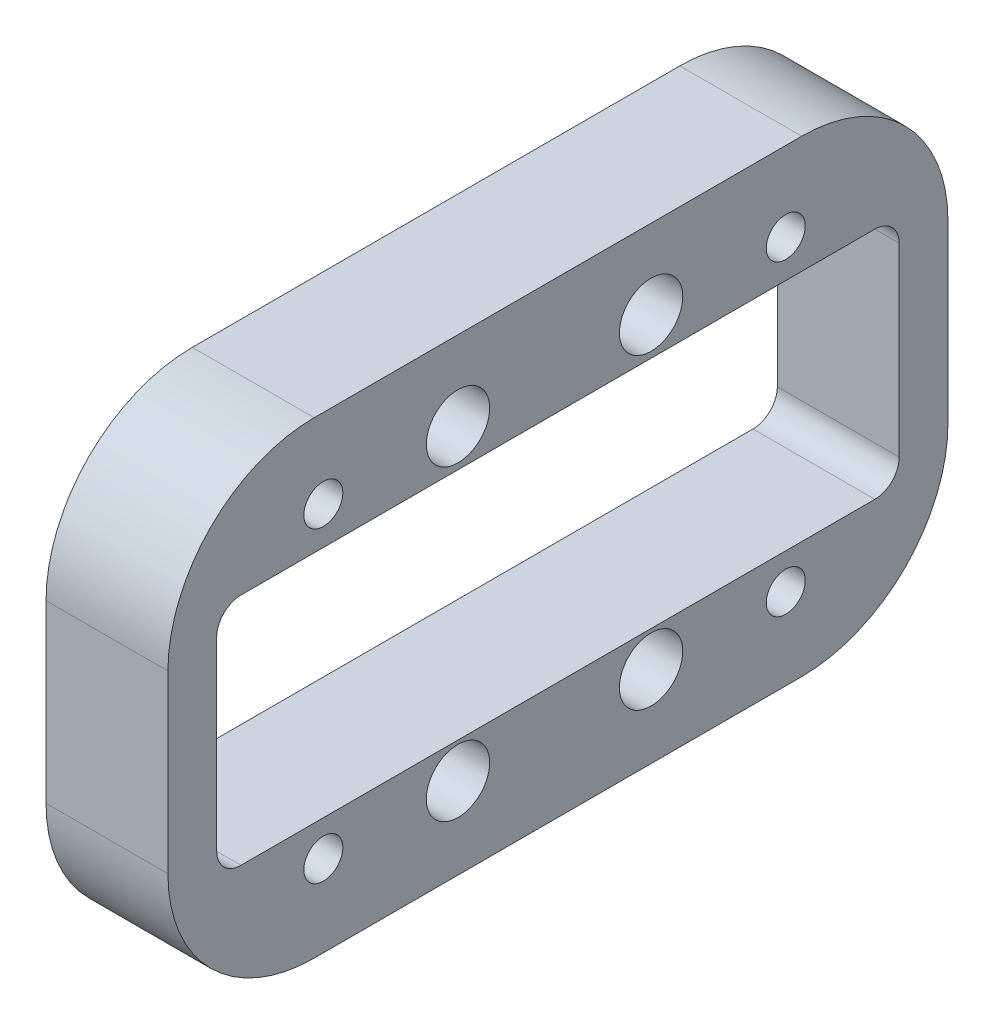
ISO-10303-21;
HEADER;
FILE_DESCRIPTION(('STEP AP214'),'2;1');
FILE_NAME('part.step','',(''),(''),'','','');
FILE_SCHEMA(('AUTOMOTIVE_DESIGN { 1 0 10303 214 1 1 1 1 }'));
ENDSEC;
DATA;
#1=APPLICATION_CONTEXT('core data for automotive mechanical design processes');
#2=APPLICATION_PROTOCOL_DEFINITION('international standard','automotive_design',2000,#1);
#3=PRODUCT_CONTEXT('',#1,'mechanical');
#4=PRODUCT('Part','Part','',(#3));
#5=PRODUCT_RELATED_PRODUCT_CATEGORY('part','',(#4));
#6=PRODUCT_DEFINITION_FORMATION('','',#4);
#7=PRODUCT_DEFINITION_CONTEXT('part definition',#1,'design');
#8=PRODUCT_DEFINITION('design','',#6,#7);
#9=PRODUCT_DEFINITION_SHAPE('','',#8);
#10=(LENGTH_UNIT() NAMED_UNIT(*) SI_UNIT(.MILLI.,.METRE.));
#11=(NAMED_UNIT(*) PLANE_ANGLE_UNIT() SI_UNIT($,.RADIAN.));
#12=(NAMED_UNIT(*) SI_UNIT($,.STERADIAN.) SOLID_ANGLE_UNIT());
#13=UNCERTAINTY_MEASURE_WITH_UNIT(LENGTH_MEASURE(1.E-05),#10,'distance_accuracy_value','');
#14=(GEOMETRIC_REPRESENTATION_CONTEXT(3) GLOBAL_UNCERTAINTY_ASSIGNED_CONTEXT((#13)) GLOBAL_UNIT_ASSIGNED_CONTEXT((#10,
#11,#12)) REPRESENTATION_CONTEXT('',''));
#15=CARTESIAN_POINT('',(0.,0.,0.));
#16=DIRECTION('',(0.,0.,1.));
#17=DIRECTION('',(1.,0.,0.));
#18=AXIS2_PLACEMENT_3D('',#15,#16,#17);
#19=CARTESIAN_POINT('',(-25.,-16.9444407434537,2.44363314199944));
#20=DIRECTION('',(1.,0.,0.));
#21=DIRECTION('',(0.,0.,-1.));
#22=AXIS2_PLACEMENT_3D('',#19,#20,#21);
#23=CYLINDRICAL_SURFACE('',#22,4.);
#24=CARTESIAN_POINT('',(-25.,-16.9444407434537,2.44363314199944));
#25=DIRECTION('',(1.,0.,0.));
#26=DIRECTION('',(0.,0.,-1.));
#27=AXIS2_PLACEMENT_3D('',#24,#25,#26);
#28=CIRCLE('',#27,4.);
#29=CARTESIAN_POINT('',(-25.,-16.9444407434537,-1.55636685800056));
#30=VERTEX_POINT('',#29);
#31=EDGE_CURVE('E306',#30,#30,#28,.T.);
#32=ORIENTED_EDGE('',*,*,#31,.F.);
#33=EDGE_LOOP('',(#32));
#34=FACE_BOUND('',#33,.T.);
#35=CARTESIAN_POINT('',(-15.,-16.9444407434537,2.44363314199944));
#36=DIRECTION('',(1.,0.,0.));
#37=DIRECTION('',(0.,0.,-1.));
#38=AXIS2_PLACEMENT_3D('',#35,#36,#37);
#39=CIRCLE('',#38,4.);
#40=CARTESIAN_POINT('',(-15.,-16.9444407434537,-1.55636685800056));
#41=VERTEX_POINT('',#40);
#42=EDGE_CURVE('E39',#41,#41,#39,.F.);
#43=ORIENTED_EDGE('',*,*,#42,.F.);
#44=EDGE_LOOP('',(#43));
#45=FACE_BOUND('',#44,.T.);
#46=ADVANCED_FACE('F35',(#34,#45),#23,.F.);
#47=CARTESIAN_POINT('',(-25.,-16.9444407434538,-37.1630199630885));
#48=DIRECTION('',(1.,0.,0.));
#49=DIRECTION('',(0.,0.,-1.));
#50=AXIS2_PLACEMENT_3D('',#47,#48,#49);
#51=CYLINDRICAL_SURFACE('',#50,4.);
#52=CARTESIAN_POINT('',(-25.,-16.9444407434538,-37.1630199630885));
#53=DIRECTION('',(1.,0.,0.));
#54=DIRECTION('',(0.,0.,-1.));
#55=AXIS2_PLACEMENT_3D('',#52,#53,#54);
#56=CIRCLE('',#55,4.);
#57=CARTESIAN_POINT('',(-25.,-16.9444407434538,-41.1630199630885));
#58=VERTEX_POINT('',#57);
#59=EDGE_CURVE('E301',#58,#58,#56,.T.);
#60=ORIENTED_EDGE('',*,*,#59,.F.);
#61=EDGE_LOOP('',(#60));
#62=FACE_BOUND('',#61,.T.);
#63=CARTESIAN_POINT('',(-15.,-16.9444407434538,-37.1630199630885));
#64=DIRECTION('',(1.,0.,0.));
#65=DIRECTION('',(0.,0.,-1.));
#66=AXIS2_PLACEMENT_3D('',#63,#64,#65);
#67=CIRCLE('',#66,4.);
#68=CARTESIAN_POINT('',(-15.,-16.9444407434538,-41.1630199630885));
#69=VERTEX_POINT('',#68);
#70=EDGE_CURVE('E252',#69,#69,#67,.F.);
#71=ORIENTED_EDGE('',*,*,#70,.F.);
#72=EDGE_LOOP('',(#71));
#73=FACE_BOUND('',#72,.T.);
#74=ADVANCED_FACE('F379',(#62,#73),#51,.F.);
#75=CARTESIAN_POINT('',(-25.,46.0633488865463,2.44363314199944));
#76=DIRECTION('',(1.,0.,0.));
#77=DIRECTION('',(0.,0.,-1.));
#78=AXIS2_PLACEMENT_3D('',#75,#76,#77);
#79=CYLINDRICAL_SURFACE('',#78,4.);
#80=CARTESIAN_POINT('',(-25.,46.0633488865463,2.44363314199944));
#81=DIRECTION('',(1.,0.,0.));
#82=DIRECTION('',(0.,0.,-1.));
#83=AXIS2_PLACEMENT_3D('',#80,#81,#82);
#84=CIRCLE('',#83,4.);
#85=CARTESIAN_POINT('',(-25.,46.0633488865463,-1.55636685800056));
#86=VERTEX_POINT('',#85);
#87=EDGE_CURVE('E324',#86,#86,#84,.T.);
#88=ORIENTED_EDGE('',*,*,#87,.F.);
#89=EDGE_LOOP('',(#88));
#90=FACE_BOUND('',#89,.T.);
#91=CARTESIAN_POINT('',(-15.,46.0633488865463,2.44363314199944));
#92=DIRECTION('',(1.,0.,0.));
#93=DIRECTION('',(0.,0.,-1.));
#94=AXIS2_PLACEMENT_3D('',#91,#92,#93);
#95=CIRCLE('',#94,4.);
#96=CARTESIAN_POINT('',(-15.,46.0633488865463,-1.55636685800056));
#97=VERTEX_POINT('',#96);
#98=EDGE_CURVE('E248',#97,#97,#95,.F.);
#99=ORIENTED_EDGE('',*,*,#98,.F.);
#100=EDGE_LOOP('',(#99));
#101=FACE_BOUND('',#100,.T.);
#102=ADVANCED_FACE('F385',(#90,#101),#79,.F.);
#103=CARTESIAN_POINT('',(-25.,46.0633488865463,-37.1630199630885));
#104=DIRECTION('',(1.,0.,0.));
#105=DIRECTION('',(0.,0.,-1.));
#106=AXIS2_PLACEMENT_3D('',#103,#104,#105);
#107=CYLINDRICAL_SURFACE('',#106,4.);
#108=CARTESIAN_POINT('',(-25.,46.0633488865463,-37.1630199630885));
#109=DIRECTION('',(1.,0.,0.));
#110=DIRECTION('',(0.,0.,-1.));
#111=AXIS2_PLACEMENT_3D('',#108,#109,#110);
#112=CIRCLE('',#111,4.);
#113=CARTESIAN_POINT('',(-25.,46.0633488865463,-41.1630199630885));
#114=VERTEX_POINT('',#113);
#115=EDGE_CURVE('E319',#114,#114,#112,.T.);
#116=ORIENTED_EDGE('',*,*,#115,.F.);
#117=EDGE_LOOP('',(#116));
#118=FACE_BOUND('',#117,.T.);
#119=CARTESIAN_POINT('',(-15.,46.0633488865463,-37.1630199630885));
#120=DIRECTION('',(1.,0.,0.));
#121=DIRECTION('',(0.,0.,-1.));
#122=AXIS2_PLACEMENT_3D('',#119,#120,#121);
#123=CIRCLE('',#122,4.);
#124=CARTESIAN_POINT('',(-15.,46.0633488865463,-41.1630199630885));
#125=VERTEX_POINT('',#124);
#126=EDGE_CURVE('E243',#125,#125,#123,.F.);
#127=ORIENTED_EDGE('',*,*,#126,.F.);
#128=EDGE_LOOP('',(#127));
#129=FACE_BOUND('',#128,.T.);
#130=ADVANCED_FACE('F402',(#118,#129),#107,.F.);
#131=CARTESIAN_POINT('',(-25.,62.3233488865462,61.94154766));
#132=DIRECTION('',(0.,0.,1.));
#133=DIRECTION('',(0.,-1.,0.));
#134=AXIS2_PLACEMENT_3D('',#131,#132,#133);
#135=PLANE('',#134);
#136=DIRECTION('',(0.,-1.,0.));
#137=VECTOR('',#136,1.);
#138=CARTESIAN_POINT('',(-25.,62.3233488865462,61.94154766));
#139=LINE('',#138,#137);
#140=CARTESIAN_POINT('',(-25.,32.3233488865462,61.94154766));
#141=VERTEX_POINT('',#140);
#142=CARTESIAN_POINT('',(-25.,-3.67665111345376,61.94154766));
#143=VERTEX_POINT('',#142);
#144=EDGE_CURVE('E332',#141,#143,#139,.T.);
#145=ORIENTED_EDGE('',*,*,#144,.T.);
#146=DIRECTION('',(1.,0.,0.));
#147=VECTOR('',#146,1.);
#148=CARTESIAN_POINT('',(-25.,-3.67665111345376,61.94154766));
#149=LINE('',#148,#147);
#150=CARTESIAN_POINT('',(0.,-3.67665111345376,61.94154766));
#151=VERTEX_POINT('',#150);
#152=EDGE_CURVE('E171',#143,#151,#149,.T.);
#153=ORIENTED_EDGE('',*,*,#152,.T.);
#154=DIRECTION('',(0.,-1.,0.));
#155=VECTOR('',#154,1.);
#156=CARTESIAN_POINT('',(0.,62.3233488865462,61.94154766));
#157=LINE('',#156,#155);
#158=CARTESIAN_POINT('',(0.,32.3233488865462,61.94154766));
#159=VERTEX_POINT('',#158);
#160=EDGE_CURVE('E154',#159,#151,#157,.T.);
#161=ORIENTED_EDGE('',*,*,#160,.F.);
#162=DIRECTION('',(1.,0.,0.));
#163=VECTOR('',#162,1.);
#164=CARTESIAN_POINT('',(-25.,32.3233488865462,61.94154766));
#165=LINE('',#164,#163);
#166=EDGE_CURVE('E168',#159,#141,#165,.F.);
#167=ORIENTED_EDGE('',*,*,#166,.T.);
#168=EDGE_LOOP('',(#145,#153,#161,#167));
#169=FACE_BOUND('',#168,.T.);
#170=ADVANCED_FACE('F167',(#169),#135,.T.);
#171=CARTESIAN_POINT('',(-25.,62.3233488865462,61.94154766));
#172=DIRECTION('',(0.,1.,0.));
#173=DIRECTION('',(0.,0.,1.));
#174=AXIS2_PLACEMENT_3D('',#171,#172,#173);
#175=PLANE('',#174);
#176=DIRECTION('',(0.,0.,1.));
#177=VECTOR('',#176,1.);
#178=CARTESIAN_POINT('',(-25.,62.3233488865462,61.94154766));
#179=LINE('',#178,#177);
#180=CARTESIAN_POINT('',(-25.,62.3233488865462,-68.05845234));
#181=VERTEX_POINT('',#180);
#182=CARTESIAN_POINT('',(-25.,62.3233488865462,31.94154766));
#183=VERTEX_POINT('',#182);
#184=EDGE_CURVE('E178',#181,#183,#179,.T.);
#185=ORIENTED_EDGE('',*,*,#184,.T.);
#186=DIRECTION('',(1.,0.,0.));
#187=VECTOR('',#186,1.);
#188=CARTESIAN_POINT('',(-25.,62.3233488865462,31.94154766));
#189=LINE('',#188,#187);
#190=CARTESIAN_POINT('',(0.,62.3233488865462,31.94154766));
#191=VERTEX_POINT('',#190);
#192=EDGE_CURVE('E205',#183,#191,#189,.T.);
#193=ORIENTED_EDGE('',*,*,#192,.T.);
#194=DIRECTION('',(0.,0.,1.));
#195=VECTOR('',#194,1.);
#196=CARTESIAN_POINT('',(0.,62.3233488865462,61.94154766));
#197=LINE('',#196,#195);
#198=CARTESIAN_POINT('',(0.,62.3233488865462,-68.05845234));
#199=VERTEX_POINT('',#198);
#200=EDGE_CURVE('E156',#199,#191,#197,.T.);
#201=ORIENTED_EDGE('',*,*,#200,.F.);
#202=DIRECTION('',(1.,0.,0.));
#203=VECTOR('',#202,1.);
#204=CARTESIAN_POINT('',(-25.,62.3233488865462,-68.05845234));
#205=LINE('',#204,#203);
#206=EDGE_CURVE('E203',#199,#181,#205,.F.);
#207=ORIENTED_EDGE('',*,*,#206,.T.);
#208=EDGE_LOOP('',(#185,#193,#201,#207));
#209=FACE_BOUND('',#208,.T.);
#210=ADVANCED_FACE('F365',(#209),#175,.T.);
#211=CARTESIAN_POINT('',(-25.,62.3233488865462,-98.05845234));
#212=DIRECTION('',(0.,0.,-1.));
#213=DIRECTION('',(0.,1.,0.));
#214=AXIS2_PLACEMENT_3D('',#211,#212,#213);
#215=PLANE('',#214);
#216=DIRECTION('',(0.,1.,0.));
#217=VECTOR('',#216,1.);
#218=CARTESIAN_POINT('',(-25.,62.3233488865462,-98.05845234));
#219=LINE('',#218,#217);
#220=CARTESIAN_POINT('',(-25.,-3.67665111345376,-98.05845234));
#221=VERTEX_POINT('',#220);
#222=CARTESIAN_POINT('',(-25.,32.3233488865462,-98.05845234));
#223=VERTEX_POINT('',#222);
#224=EDGE_CURVE('E183',#221,#223,#219,.T.);
#225=ORIENTED_EDGE('',*,*,#224,.T.);
#226=DIRECTION('',(1.,0.,0.));
#227=VECTOR('',#226,1.);
#228=CARTESIAN_POINT('',(-25.,32.3233488865462,-98.05845234));
#229=LINE('',#228,#227);
#230=CARTESIAN_POINT('',(0.,32.3233488865462,-98.05845234));
#231=VERTEX_POINT('',#230);
#232=EDGE_CURVE('E209',#223,#231,#229,.T.);
#233=ORIENTED_EDGE('',*,*,#232,.T.);
#234=DIRECTION('',(0.,1.,0.));
#235=VECTOR('',#234,1.);
#236=CARTESIAN_POINT('',(0.,62.3233488865462,-98.05845234));
#237=LINE('',#236,#235);
#238=CARTESIAN_POINT('',(0.,-3.67665111345376,-98.05845234));
#239=VERTEX_POINT('',#238);
#240=EDGE_CURVE('E340',#239,#231,#237,.T.);
#241=ORIENTED_EDGE('',*,*,#240,.F.);
#242=DIRECTION('',(1.,0.,0.));
#243=VECTOR('',#242,1.);
#244=CARTESIAN_POINT('',(-25.,-3.67665111345376,-98.05845234));
#245=LINE('',#244,#243);
#246=EDGE_CURVE('E207',#239,#221,#245,.F.);
#247=ORIENTED_EDGE('',*,*,#246,.T.);
#248=EDGE_LOOP('',(#225,#233,#241,#247));
#249=FACE_BOUND('',#248,.T.);
#250=ADVANCED_FACE('F345',(#249),#215,.T.);
#251=CARTESIAN_POINT('',(-25.,-33.6766511134538,61.94154766));
#252=DIRECTION('',(0.,-1.,0.));
#253=DIRECTION('',(0.,0.,-1.));
#254=AXIS2_PLACEMENT_3D('',#251,#252,#253);
#255=PLANE('',#254);
#256=DIRECTION('',(0.,0.,-1.));
#257=VECTOR('',#256,1.);
#258=CARTESIAN_POINT('',(0.,-33.6766511134538,61.94154766));
#259=LINE('',#258,#257);
#260=CARTESIAN_POINT('',(0.,-33.6766511134538,31.94154766));
#261=VERTEX_POINT('',#260);
#262=CARTESIAN_POINT('',(0.,-33.6766511134538,-68.05845234));
#263=VERTEX_POINT('',#262);
#264=EDGE_CURVE('E172',#261,#263,#259,.T.);
#265=ORIENTED_EDGE('',*,*,#264,.F.);
#266=DIRECTION('',(1.,0.,0.));
#267=VECTOR('',#266,1.);
#268=CARTESIAN_POINT('',(-25.,-33.6766511134538,31.94154766));
#269=LINE('',#268,#267);
#270=CARTESIAN_POINT('',(-25.,-33.6766511134538,31.94154766));
#271=VERTEX_POINT('',#270);
#272=EDGE_CURVE('E194',#261,#271,#269,.F.);
#273=ORIENTED_EDGE('',*,*,#272,.T.);
#274=DIRECTION('',(0.,0.,-1.));
#275=VECTOR('',#274,1.);
#276=CARTESIAN_POINT('',(-25.,-33.6766511134538,61.94154766));
#277=LINE('',#276,#275);
#278=CARTESIAN_POINT('',(-25.,-33.6766511134538,-68.05845234));
#279=VERTEX_POINT('',#278);
#280=EDGE_CURVE('E334',#271,#279,#277,.T.);
#281=ORIENTED_EDGE('',*,*,#280,.T.);
#282=DIRECTION('',(1.,0.,0.));
#283=VECTOR('',#282,1.);
#284=CARTESIAN_POINT('',(-25.,-33.6766511134538,-68.05845234));
#285=LINE('',#284,#283);
#286=EDGE_CURVE('E191',#279,#263,#285,.T.);
#287=ORIENTED_EDGE('',*,*,#286,.T.);
#288=EDGE_LOOP('',(#265,#273,#281,#287));
#289=FACE_BOUND('',#288,.T.);
#290=ADVANCED_FACE('F358',(#289),#255,.T.);
#291=CARTESIAN_POINT('',(-25.,0.,0.));
#292=DIRECTION('',(1.,0.,0.));
#293=DIRECTION('',(0.,0.,-1.));
#294=AXIS2_PLACEMENT_3D('',#291,#292,#293);
#295=PLANE('',#294);
#296=DIRECTION('',(0.,1.,0.));
#297=VECTOR('',#296,1.);
#298=CARTESIAN_POINT('',(-25.,38.3233488865462,-88.05845234));
#299=LINE('',#298,#297);
#300=CARTESIAN_POINT('',(-25.,-4.67665111345376,-88.05845234));
#301=VERTEX_POINT('',#300);
#302=CARTESIAN_POINT('',(-25.,33.3233488865462,-88.05845234));
#303=VERTEX_POINT('',#302);
#304=EDGE_CURVE('E283',#301,#303,#299,.T.);
#305=ORIENTED_EDGE('',*,*,#304,.T.);
#306=CARTESIAN_POINT('',(-25.,33.3233488865462,-83.05845234));
#307=DIRECTION('',(1.,0.,0.));
#308=DIRECTION('',(0.,0.,-1.));
#309=AXIS2_PLACEMENT_3D('',#306,#307,#308);
#310=CIRCLE('',#309,5.);
#311=CARTESIAN_POINT('',(-25.,38.3233488865462,-83.05845234));
#312=VERTEX_POINT('',#311);
#313=EDGE_CURVE('E11',#303,#312,#310,.T.);
#314=ORIENTED_EDGE('',*,*,#313,.T.);
#315=DIRECTION('',(0.,0.,1.));
#316=VECTOR('',#315,1.);
#317=CARTESIAN_POINT('',(-25.,38.3233488865462,51.94154766));
#318=LINE('',#317,#316);
#319=CARTESIAN_POINT('',(-25.,38.3233488865462,46.94154766));
#320=VERTEX_POINT('',#319);
#321=EDGE_CURVE('E285',#312,#320,#318,.T.);
#322=ORIENTED_EDGE('',*,*,#321,.T.);
#323=CARTESIAN_POINT('',(-25.,33.3233488865462,46.94154766));
#324=DIRECTION('',(1.,0.,0.));
#325=DIRECTION('',(0.,0.,-1.));
#326=AXIS2_PLACEMENT_3D('',#323,#324,#325);
#327=CIRCLE('',#326,5.);
#328=CARTESIAN_POINT('',(-25.,33.3233488865462,51.94154766));
#329=VERTEX_POINT('',#328);
#330=EDGE_CURVE('E237',#320,#329,#327,.T.);
#331=ORIENTED_EDGE('',*,*,#330,.T.);
#332=DIRECTION('',(0.,-1.,0.));
#333=VECTOR('',#332,1.);
#334=CARTESIAN_POINT('',(-25.,38.3233488865462,51.94154766));
#335=LINE('',#334,#333);
#336=CARTESIAN_POINT('',(-25.,-4.67665111345376,51.94154766));
#337=VERTEX_POINT('',#336);
#338=EDGE_CURVE('E277',#329,#337,#335,.T.);
#339=ORIENTED_EDGE('',*,*,#338,.T.);
#340=CARTESIAN_POINT('',(-25.,-4.67665111345375,46.94154766));
#341=DIRECTION('',(1.,0.,0.));
#342=DIRECTION('',(0.,0.,-1.));
#343=AXIS2_PLACEMENT_3D('',#340,#341,#342);
#344=CIRCLE('',#343,5.);
#345=CARTESIAN_POINT('',(-25.,-9.67665111345375,46.94154766));
#346=VERTEX_POINT('',#345);
#347=EDGE_CURVE('E233',#337,#346,#344,.T.);
#348=ORIENTED_EDGE('',*,*,#347,.T.);
#349=DIRECTION('',(0.,0.,-1.));
#350=VECTOR('',#349,1.);
#351=CARTESIAN_POINT('',(-25.,-9.67665111345375,51.94154766));
#352=LINE('',#351,#350);
#353=CARTESIAN_POINT('',(-25.,-9.67665111345375,-83.05845234));
#354=VERTEX_POINT('',#353);
#355=EDGE_CURVE('E280',#346,#354,#352,.T.);
#356=ORIENTED_EDGE('',*,*,#355,.T.);
#357=CARTESIAN_POINT('',(-25.,-4.67665111345376,-83.05845234));
#358=DIRECTION('',(1.,0.,0.));
#359=DIRECTION('',(0.,0.,-1.));
#360=AXIS2_PLACEMENT_3D('',#357,#358,#359);
#361=CIRCLE('',#360,5.);
#362=EDGE_CURVE('E59',#354,#301,#361,.T.);
#363=ORIENTED_EDGE('',*,*,#362,.T.);
#364=EDGE_LOOP('',(#305,#314,#322,#331,#339,#348,#356,#363));
#365=FACE_BOUND('',#364,.T.);
#366=CARTESIAN_POINT('',(-25.,46.0633488865463,30.0636331419994));
#367=DIRECTION('',(1.,0.,0.));
#368=DIRECTION('',(0.,0.,-1.));
#369=AXIS2_PLACEMENT_3D('',#366,#367,#368);
#370=CIRCLE('',#369,4.);
#371=CARTESIAN_POINT('',(-25.,46.0633488865463,26.0636331419994));
#372=VERTEX_POINT('',#371);
#373=EDGE_CURVE('E298',#372,#372,#370,.T.);
#374=ORIENTED_EDGE('',*,*,#373,.T.);
#375=EDGE_LOOP('',(#374));
#376=FACE_BOUND('',#375,.T.);
#377=ORIENTED_EDGE('',*,*,#59,.T.);
#378=EDGE_LOOP('',(#377));
#379=FACE_BOUND('',#378,.T.);
#380=ORIENTED_EDGE('',*,*,#31,.T.);
#381=EDGE_LOOP('',(#380));
#382=FACE_BOUND('',#381,.T.);
#383=CARTESIAN_POINT('',(-25.,-16.9444407434538,-64.7845816930885));
#384=DIRECTION('',(1.,0.,0.));
#385=DIRECTION('',(0.,0.,-1.));
#386=AXIS2_PLACEMENT_3D('',#383,#384,#385);
#387=CIRCLE('',#386,4.00000000000001);
#388=CARTESIAN_POINT('',(-25.,-16.9444407434538,-68.7845816930885));
#389=VERTEX_POINT('',#388);
#390=EDGE_CURVE('E310',#389,#389,#387,.T.);
#391=ORIENTED_EDGE('',*,*,#390,.T.);
#392=EDGE_LOOP('',(#391));
#393=FACE_BOUND('',#392,.T.);
#394=CARTESIAN_POINT('',(-25.,-16.9444407434537,30.0636331419994));
#395=DIRECTION('',(1.,0.,0.));
#396=DIRECTION('',(0.,0.,-1.));
#397=AXIS2_PLACEMENT_3D('',#394,#395,#396);
#398=CIRCLE('',#397,4.);
#399=CARTESIAN_POINT('',(-25.,-16.9444407434537,26.0636331419994));
#400=VERTEX_POINT('',#399);
#401=EDGE_CURVE('E316',#400,#400,#398,.T.);
#402=ORIENTED_EDGE('',*,*,#401,.T.);
#403=EDGE_LOOP('',(#402));
#404=FACE_BOUND('',#403,.T.);
#405=ORIENTED_EDGE('',*,*,#115,.T.);
#406=EDGE_LOOP('',(#405));
#407=FACE_BOUND('',#406,.T.);
#408=ORIENTED_EDGE('',*,*,#87,.T.);
#409=EDGE_LOOP('',(#408));
#410=FACE_BOUND('',#409,.T.);
#411=CARTESIAN_POINT('',(-25.,46.0633488865463,-64.7845816930885));
#412=DIRECTION('',(1.,0.,0.));
#413=DIRECTION('',(0.,0.,-1.));
#414=AXIS2_PLACEMENT_3D('',#411,#412,#413);
#415=CIRCLE('',#414,4.00000000000001);
#416=CARTESIAN_POINT('',(-25.,46.0633488865463,-68.7845816930885));
#417=VERTEX_POINT('',#416);
#418=EDGE_CURVE('E173',#417,#417,#415,.T.);
#419=ORIENTED_EDGE('',*,*,#418,.T.);
#420=EDGE_LOOP('',(#419));
#421=FACE_BOUND('',#420,.T.);
#422=ORIENTED_EDGE('',*,*,#280,.F.);
#423=CARTESIAN_POINT('',(-25.,-3.67665111345375,31.94154766));
#424=DIRECTION('',(1.,0.,0.));
#425=DIRECTION('',(0.,0.,-1.));
#426=AXIS2_PLACEMENT_3D('',#423,#424,#425);
#427=CIRCLE('',#426,30.);
#428=EDGE_CURVE('E201',#271,#143,#427,.F.);
#429=ORIENTED_EDGE('',*,*,#428,.T.);
#430=ORIENTED_EDGE('',*,*,#144,.F.);
#431=CARTESIAN_POINT('',(-25.,32.3233488865462,31.94154766));
#432=DIRECTION('',(1.,0.,0.));
#433=DIRECTION('',(0.,0.,-1.));
#434=AXIS2_PLACEMENT_3D('',#431,#432,#433);
#435=CIRCLE('',#434,30.);
#436=EDGE_CURVE('E177',#141,#183,#435,.F.);
#437=ORIENTED_EDGE('',*,*,#436,.T.);
#438=ORIENTED_EDGE('',*,*,#184,.F.);
#439=CARTESIAN_POINT('',(-25.,32.3233488865462,-68.05845234));
#440=DIRECTION('',(1.,0.,0.));
#441=DIRECTION('',(0.,0.,-1.));
#442=AXIS2_PLACEMENT_3D('',#439,#440,#441);
#443=CIRCLE('',#442,30.);
#444=EDGE_CURVE('E198',#181,#223,#443,.F.);
#445=ORIENTED_EDGE('',*,*,#444,.T.);
#446=ORIENTED_EDGE('',*,*,#224,.F.);
#447=CARTESIAN_POINT('',(-25.,-3.67665111345376,-68.05845234));
#448=DIRECTION('',(1.,0.,0.));
#449=DIRECTION('',(0.,0.,-1.));
#450=AXIS2_PLACEMENT_3D('',#447,#448,#449);
#451=CIRCLE('',#450,30.);
#452=EDGE_CURVE('E196',#221,#279,#451,.F.);
#453=ORIENTED_EDGE('',*,*,#452,.T.);
#454=EDGE_LOOP('',(#422,#429,#430,#437,#438,#445,#446,#453));
#455=FACE_BOUND('',#454,.T.);
#456=ADVANCED_FACE('F354',(#365,#376,#379,#382,#393,#404,#407,#410,#421,#455),#295,.F.);
#457=CARTESIAN_POINT('',(0.,0.,0.));
#458=DIRECTION('',(1.,0.,0.));
#459=DIRECTION('',(0.,0.,-1.));
#460=AXIS2_PLACEMENT_3D('',#457,#458,#459);
#461=PLANE('',#460);
#462=CARTESIAN_POINT('',(0.,-16.9444407434537,2.44363314199944));
#463=DIRECTION('',(1.,0.,0.));
#464=DIRECTION('',(0.,0.,-1.));
#465=AXIS2_PLACEMENT_3D('',#462,#463,#464);
#466=CIRCLE('',#465,6.5);
#467=CARTESIAN_POINT('',(0.,-16.9444407434537,-4.05636685800056));
#468=VERTEX_POINT('',#467);
#469=EDGE_CURVE('E268',#468,#468,#466,.T.);
#470=ORIENTED_EDGE('',*,*,#469,.F.);
#471=EDGE_LOOP('',(#470));
#472=FACE_BOUND('',#471,.T.);
#473=CARTESIAN_POINT('',(0.,-16.9444407434538,-37.1630199630885));
#474=DIRECTION('',(1.,0.,0.));
#475=DIRECTION('',(0.,0.,-1.));
#476=AXIS2_PLACEMENT_3D('',#473,#474,#475);
#477=CIRCLE('',#476,6.5);
#478=CARTESIAN_POINT('',(0.,-16.9444407434538,-43.6630199630885));
#479=VERTEX_POINT('',#478);
#480=EDGE_CURVE('E261',#479,#479,#477,.T.);
#481=ORIENTED_EDGE('',*,*,#480,.F.);
#482=EDGE_LOOP('',(#481));
#483=FACE_BOUND('',#482,.T.);
#484=CARTESIAN_POINT('',(0.,46.0633488865463,2.44363314199944));
#485=DIRECTION('',(1.,0.,0.));
#486=DIRECTION('',(0.,0.,-1.));
#487=AXIS2_PLACEMENT_3D('',#484,#485,#486);
#488=CIRCLE('',#487,6.5);
#489=CARTESIAN_POINT('',(0.,46.0633488865463,-4.05636685800056));
#490=VERTEX_POINT('',#489);
#491=EDGE_CURVE('E254',#490,#490,#488,.T.);
#492=ORIENTED_EDGE('',*,*,#491,.F.);
#493=EDGE_LOOP('',(#492));
#494=FACE_BOUND('',#493,.T.);
#495=CARTESIAN_POINT('',(0.,46.0633488865463,-37.1630199630885));
#496=DIRECTION('',(1.,0.,0.));
#497=DIRECTION('',(0.,0.,-1.));
#498=AXIS2_PLACEMENT_3D('',#495,#496,#497);
#499=CIRCLE('',#498,6.49816954425847);
#500=CARTESIAN_POINT('',(0.,46.0633488865463,-43.6611895073469));
#501=VERTEX_POINT('',#500);
#502=EDGE_CURVE('E250',#501,#501,#499,.T.);
#503=ORIENTED_EDGE('',*,*,#502,.F.);
#504=EDGE_LOOP('',(#503));
#505=FACE_BOUND('',#504,.T.);
#506=DIRECTION('',(0.,-1.,0.));
#507=VECTOR('',#506,1.);
#508=CARTESIAN_POINT('',(0.,38.3233488865462,51.94154766));
#509=LINE('',#508,#507);
#510=CARTESIAN_POINT('',(0.,33.3233488865462,51.94154766));
#511=VERTEX_POINT('',#510);
#512=CARTESIAN_POINT('',(0.,-4.67665111345376,51.94154766));
#513=VERTEX_POINT('',#512);
#514=EDGE_CURVE('E246',#511,#513,#509,.T.);
#515=ORIENTED_EDGE('',*,*,#514,.F.);
#516=CARTESIAN_POINT('',(0.,33.3233488865462,46.94154766));
#517=DIRECTION('',(1.,0.,0.));
#518=DIRECTION('',(0.,0.,-1.));
#519=AXIS2_PLACEMENT_3D('',#516,#517,#518);
#520=CIRCLE('',#519,5.);
#521=CARTESIAN_POINT('',(0.,38.3233488865462,46.94154766));
#522=VERTEX_POINT('',#521);
#523=EDGE_CURVE('E235',#511,#522,#520,.F.);
#524=ORIENTED_EDGE('',*,*,#523,.T.);
#525=DIRECTION('',(0.,0.,1.));
#526=VECTOR('',#525,1.);
#527=CARTESIAN_POINT('',(0.,38.3233488865462,51.94154766));
#528=LINE('',#527,#526);
#529=CARTESIAN_POINT('',(0.,38.3233488865462,-83.05845234));
#530=VERTEX_POINT('',#529);
#531=EDGE_CURVE('E281',#530,#522,#528,.T.);
#532=ORIENTED_EDGE('',*,*,#531,.F.);
#533=CARTESIAN_POINT('',(0.,33.3233488865462,-83.05845234));
#534=DIRECTION('',(1.,0.,0.));
#535=DIRECTION('',(0.,0.,-1.));
#536=AXIS2_PLACEMENT_3D('',#533,#534,#535);
#537=CIRCLE('',#536,5.);
#538=CARTESIAN_POINT('',(0.,33.3233488865462,-88.05845234));
#539=VERTEX_POINT('',#538);
#540=EDGE_CURVE('E44',#530,#539,#537,.F.);
#541=ORIENTED_EDGE('',*,*,#540,.T.);
#542=DIRECTION('',(0.,1.,0.));
#543=VECTOR('',#542,1.);
#544=CARTESIAN_POINT('',(0.,38.3233488865462,-88.05845234));
#545=LINE('',#544,#543);
#546=CARTESIAN_POINT('',(0.,-4.67665111345376,-88.05845234));
#547=VERTEX_POINT('',#546);
#548=EDGE_CURVE('E294',#547,#539,#545,.T.);
#549=ORIENTED_EDGE('',*,*,#548,.F.);
#550=CARTESIAN_POINT('',(0.,-4.67665111345376,-83.05845234));
#551=DIRECTION('',(1.,0.,0.));
#552=DIRECTION('',(0.,0.,-1.));
#553=AXIS2_PLACEMENT_3D('',#550,#551,#552);
#554=CIRCLE('',#553,5.);
#555=CARTESIAN_POINT('',(0.,-9.67665111345375,-83.05845234));
#556=VERTEX_POINT('',#555);
#557=EDGE_CURVE('E239',#547,#556,#554,.F.);
#558=ORIENTED_EDGE('',*,*,#557,.T.);
#559=DIRECTION('',(0.,0.,-1.));
#560=VECTOR('',#559,1.);
#561=CARTESIAN_POINT('',(0.,-9.67665111345375,51.94154766));
#562=LINE('',#561,#560);
#563=CARTESIAN_POINT('',(0.,-9.67665111345375,46.94154766));
#564=VERTEX_POINT('',#563);
#565=EDGE_CURVE('E291',#564,#556,#562,.T.);
#566=ORIENTED_EDGE('',*,*,#565,.F.);
#567=CARTESIAN_POINT('',(0.,-4.67665111345375,46.94154766));
#568=DIRECTION('',(1.,0.,0.));
#569=DIRECTION('',(0.,0.,-1.));
#570=AXIS2_PLACEMENT_3D('',#567,#568,#569);
#571=CIRCLE('',#570,5.);
#572=EDGE_CURVE('E231',#564,#513,#571,.F.);
#573=ORIENTED_EDGE('',*,*,#572,.T.);
#574=EDGE_LOOP('',(#515,#524,#532,#541,#549,#558,#566,#573));
#575=FACE_BOUND('',#574,.T.);
#576=CARTESIAN_POINT('',(0.,46.0633488865463,30.0636331419994));
#577=DIRECTION('',(1.,0.,0.));
#578=DIRECTION('',(0.,0.,-1.));
#579=AXIS2_PLACEMENT_3D('',#576,#577,#578);
#580=CIRCLE('',#579,4.);
#581=CARTESIAN_POINT('',(0.,46.0633488865463,26.0636331419994));
#582=VERTEX_POINT('',#581);
#583=EDGE_CURVE('E288',#582,#582,#580,.T.);
#584=ORIENTED_EDGE('',*,*,#583,.F.);
#585=EDGE_LOOP('',(#584));
#586=FACE_BOUND('',#585,.T.);
#587=CARTESIAN_POINT('',(0.,-16.9444407434538,-64.7845816930885));
#588=DIRECTION('',(1.,0.,0.));
#589=DIRECTION('',(0.,0.,-1.));
#590=AXIS2_PLACEMENT_3D('',#587,#588,#589);
#591=CIRCLE('',#590,4.00000000000001);
#592=CARTESIAN_POINT('',(0.,-16.9444407434538,-68.7845816930885));
#593=VERTEX_POINT('',#592);
#594=EDGE_CURVE('E309',#593,#593,#591,.T.);
#595=ORIENTED_EDGE('',*,*,#594,.F.);
#596=EDGE_LOOP('',(#595));
#597=FACE_BOUND('',#596,.T.);
#598=CARTESIAN_POINT('',(0.,-16.9444407434537,30.0636331419994));
#599=DIRECTION('',(1.,0.,0.));
#600=DIRECTION('',(0.,0.,-1.));
#601=AXIS2_PLACEMENT_3D('',#598,#599,#600);
#602=CIRCLE('',#601,4.);
#603=CARTESIAN_POINT('',(0.,-16.9444407434537,26.0636331419994));
#604=VERTEX_POINT('',#603);
#605=EDGE_CURVE('E313',#604,#604,#602,.T.);
#606=ORIENTED_EDGE('',*,*,#605,.F.);
#607=EDGE_LOOP('',(#606));
#608=FACE_BOUND('',#607,.T.);
#609=CARTESIAN_POINT('',(0.,46.0633488865463,-64.7845816930885));
#610=DIRECTION('',(1.,0.,0.));
#611=DIRECTION('',(0.,0.,-1.));
#612=AXIS2_PLACEMENT_3D('',#609,#610,#611);
#613=CIRCLE('',#612,4.00000000000001);
#614=CARTESIAN_POINT('',(0.,46.0633488865463,-68.7845816930885));
#615=VERTEX_POINT('',#614);
#616=EDGE_CURVE('E327',#615,#615,#613,.T.);
#617=ORIENTED_EDGE('',*,*,#616,.F.);
#618=EDGE_LOOP('',(#617));
#619=FACE_BOUND('',#618,.T.);
#620=ORIENTED_EDGE('',*,*,#160,.T.);
#621=CARTESIAN_POINT('',(0.,-3.67665111345375,31.94154766));
#622=DIRECTION('',(1.,0.,0.));
#623=DIRECTION('',(0.,0.,-1.));
#624=AXIS2_PLACEMENT_3D('',#621,#622,#623);
#625=CIRCLE('',#624,30.);
#626=EDGE_CURVE('E161',#151,#261,#625,.T.);
#627=ORIENTED_EDGE('',*,*,#626,.T.);
#628=ORIENTED_EDGE('',*,*,#264,.T.);
#629=CARTESIAN_POINT('',(0.,-3.67665111345376,-68.05845234));
#630=DIRECTION('',(1.,0.,0.));
#631=DIRECTION('',(0.,0.,-1.));
#632=AXIS2_PLACEMENT_3D('',#629,#630,#631);
#633=CIRCLE('',#632,30.);
#634=EDGE_CURVE('E180',#263,#239,#633,.T.);
#635=ORIENTED_EDGE('',*,*,#634,.T.);
#636=ORIENTED_EDGE('',*,*,#240,.T.);
#637=CARTESIAN_POINT('',(0.,32.3233488865462,-68.05845234));
#638=DIRECTION('',(1.,0.,0.));
#639=DIRECTION('',(0.,0.,-1.));
#640=AXIS2_PLACEMENT_3D('',#637,#638,#639);
#641=CIRCLE('',#640,30.);
#642=EDGE_CURVE('E162',#231,#199,#641,.T.);
#643=ORIENTED_EDGE('',*,*,#642,.T.);
#644=ORIENTED_EDGE('',*,*,#200,.T.);
#645=CARTESIAN_POINT('',(0.,32.3233488865462,31.94154766));
#646=DIRECTION('',(1.,0.,0.));
#647=DIRECTION('',(0.,0.,-1.));
#648=AXIS2_PLACEMENT_3D('',#645,#646,#647);
#649=CIRCLE('',#648,30.);
#650=EDGE_CURVE('E151',#191,#159,#649,.T.);
#651=ORIENTED_EDGE('',*,*,#650,.T.);
#652=EDGE_LOOP('',(#620,#627,#628,#635,#636,#643,#644,#651));
#653=FACE_BOUND('',#652,.T.);
#654=ADVANCED_FACE('F153',(#472,#483,#494,#505,#575,#586,#597,#608,#619,#653),#461,.T.);
#655=CARTESIAN_POINT('',(-25.,46.0633488865463,-64.7845816930885));
#656=DIRECTION('',(1.,0.,0.));
#657=DIRECTION('',(0.,0.,-1.));
#658=AXIS2_PLACEMENT_3D('',#655,#656,#657);
#659=CYLINDRICAL_SURFACE('',#658,4.00000000000001);
#660=ORIENTED_EDGE('',*,*,#418,.F.);
#661=EDGE_LOOP('',(#660));
#662=FACE_BOUND('',#661,.T.);
#663=ORIENTED_EDGE('',*,*,#616,.T.);
#664=EDGE_LOOP('',(#663));
#665=FACE_BOUND('',#664,.T.);
#666=ADVANCED_FACE('F400',(#662,#665),#659,.F.);
#667=CARTESIAN_POINT('',(-25.,-16.9444407434537,30.0636331419994));
#668=DIRECTION('',(1.,0.,0.));
#669=DIRECTION('',(0.,0.,-1.));
#670=AXIS2_PLACEMENT_3D('',#667,#668,#669);
#671=CYLINDRICAL_SURFACE('',#670,4.);
#672=ORIENTED_EDGE('',*,*,#401,.F.);
#673=EDGE_LOOP('',(#672));
#674=FACE_BOUND('',#673,.T.);
#675=ORIENTED_EDGE('',*,*,#605,.T.);
#676=EDGE_LOOP('',(#675));
#677=FACE_BOUND('',#676,.T.);
#678=ADVANCED_FACE('F396',(#674,#677),#671,.F.);
#679=CARTESIAN_POINT('',(-25.,-16.9444407434538,-64.7845816930885));
#680=DIRECTION('',(1.,0.,0.));
#681=DIRECTION('',(0.,0.,-1.));
#682=AXIS2_PLACEMENT_3D('',#679,#680,#681);
#683=CYLINDRICAL_SURFACE('',#682,4.00000000000001);
#684=ORIENTED_EDGE('',*,*,#390,.F.);
#685=EDGE_LOOP('',(#684));
#686=FACE_BOUND('',#685,.T.);
#687=ORIENTED_EDGE('',*,*,#594,.T.);
#688=EDGE_LOOP('',(#687));
#689=FACE_BOUND('',#688,.T.);
#690=ADVANCED_FACE('F392',(#686,#689),#683,.F.);
#691=CARTESIAN_POINT('',(-25.,46.0633488865463,30.0636331419994));
#692=DIRECTION('',(1.,0.,0.));
#693=DIRECTION('',(0.,0.,-1.));
#694=AXIS2_PLACEMENT_3D('',#691,#692,#693);
#695=CYLINDRICAL_SURFACE('',#694,4.);
#696=ORIENTED_EDGE('',*,*,#373,.F.);
#697=EDGE_LOOP('',(#696));
#698=FACE_BOUND('',#697,.T.);
#699=ORIENTED_EDGE('',*,*,#583,.T.);
#700=EDGE_LOOP('',(#699));
#701=FACE_BOUND('',#700,.T.);
#702=ADVANCED_FACE('F395',(#698,#701),#695,.F.);
#703=CARTESIAN_POINT('',(-25.,38.3233488865462,51.94154766));
#704=DIRECTION('',(0.,0.,1.));
#705=DIRECTION('',(0.,-1.,0.));
#706=AXIS2_PLACEMENT_3D('',#703,#704,#705);
#707=PLANE('',#706);
#708=ORIENTED_EDGE('',*,*,#514,.T.);
#709=DIRECTION('',(1.,0.,0.));
#710=VECTOR('',#709,1.);
#711=CARTESIAN_POINT('',(-25.,-4.67665111345376,51.94154766));
#712=LINE('',#711,#710);
#713=EDGE_CURVE('E220',#513,#337,#712,.F.);
#714=ORIENTED_EDGE('',*,*,#713,.T.);
#715=ORIENTED_EDGE('',*,*,#338,.F.);
#716=DIRECTION('',(1.,0.,0.));
#717=VECTOR('',#716,1.);
#718=CARTESIAN_POINT('',(0.,33.3233488865462,51.94154766));
#719=LINE('',#718,#717);
#720=EDGE_CURVE('E217',#329,#511,#719,.T.);
#721=ORIENTED_EDGE('',*,*,#720,.T.);
#722=EDGE_LOOP('',(#708,#714,#715,#721));
#723=FACE_BOUND('',#722,.T.);
#724=ADVANCED_FACE('F441',(#723),#707,.F.);
#725=CARTESIAN_POINT('',(-25.,38.3233488865462,51.94154766));
#726=DIRECTION('',(0.,1.,0.));
#727=DIRECTION('',(0.,0.,1.));
#728=AXIS2_PLACEMENT_3D('',#725,#726,#727);
#729=PLANE('',#728);
#730=ORIENTED_EDGE('',*,*,#531,.T.);
#731=DIRECTION('',(1.,0.,0.));
#732=VECTOR('',#731,1.);
#733=CARTESIAN_POINT('',(-25.,38.3233488865462,46.94154766));
#734=LINE('',#733,#732);
#735=EDGE_CURVE('E225',#522,#320,#734,.F.);
#736=ORIENTED_EDGE('',*,*,#735,.T.);
#737=ORIENTED_EDGE('',*,*,#321,.F.);
#738=DIRECTION('',(1.,0.,0.));
#739=VECTOR('',#738,1.);
#740=CARTESIAN_POINT('',(0.,38.3233488865462,-83.05845234));
#741=LINE('',#740,#739);
#742=EDGE_CURVE('E222',#312,#530,#741,.T.);
#743=ORIENTED_EDGE('',*,*,#742,.T.);
#744=EDGE_LOOP('',(#730,#736,#737,#743));
#745=FACE_BOUND('',#744,.T.);
#746=ADVANCED_FACE('F436',(#745),#729,.F.);
#747=CARTESIAN_POINT('',(-25.,38.3233488865462,-88.05845234));
#748=DIRECTION('',(0.,0.,-1.));
#749=DIRECTION('',(-1.,0.,0.));
#750=AXIS2_PLACEMENT_3D('',#747,#748,#749);
#751=PLANE('',#750);
#752=ORIENTED_EDGE('',*,*,#304,.F.);
#753=DIRECTION('',(1.,0.,0.));
#754=VECTOR('',#753,1.);
#755=CARTESIAN_POINT('',(0.,-4.67665111345376,-88.05845234));
#756=LINE('',#755,#754);
#757=EDGE_CURVE('E228',#301,#547,#756,.T.);
#758=ORIENTED_EDGE('',*,*,#757,.T.);
#759=ORIENTED_EDGE('',*,*,#548,.T.);
#760=DIRECTION('',(1.,0.,0.));
#761=VECTOR('',#760,1.);
#762=CARTESIAN_POINT('',(-25.,33.3233488865462,-88.05845234));
#763=LINE('',#762,#761);
#764=EDGE_CURVE('E52',#539,#303,#763,.F.);
#765=ORIENTED_EDGE('',*,*,#764,.T.);
#766=EDGE_LOOP('',(#752,#758,#759,#765));
#767=FACE_BOUND('',#766,.T.);
#768=ADVANCED_FACE('F430',(#767),#751,.F.);
#769=CARTESIAN_POINT('',(-25.,-9.67665111345375,51.94154766));
#770=DIRECTION('',(0.,-1.,0.));
#771=DIRECTION('',(0.,0.,-1.));
#772=AXIS2_PLACEMENT_3D('',#769,#770,#771);
#773=PLANE('',#772);
#774=ORIENTED_EDGE('',*,*,#355,.F.);
#775=DIRECTION('',(1.,0.,0.));
#776=VECTOR('',#775,1.);
#777=CARTESIAN_POINT('',(0.,-9.67665111345375,46.94154766));
#778=LINE('',#777,#776);
#779=EDGE_CURVE('E214',#346,#564,#778,.T.);
#780=ORIENTED_EDGE('',*,*,#779,.T.);
#781=ORIENTED_EDGE('',*,*,#565,.T.);
#782=DIRECTION('',(1.,0.,0.));
#783=VECTOR('',#782,1.);
#784=CARTESIAN_POINT('',(-25.,-9.67665111345375,-83.05845234));
#785=LINE('',#784,#783);
#786=EDGE_CURVE('E212',#556,#354,#785,.F.);
#787=ORIENTED_EDGE('',*,*,#786,.T.);
#788=EDGE_LOOP('',(#774,#780,#781,#787));
#789=FACE_BOUND('',#788,.T.);
#790=ADVANCED_FACE('F426',(#789),#773,.F.);
#791=CARTESIAN_POINT('',(-25.,-3.67665111345375,31.94154766));
#792=DIRECTION('',(1.,0.,0.));
#793=DIRECTION('',(0.,0.,-1.));
#794=AXIS2_PLACEMENT_3D('',#791,#792,#793);
#795=CYLINDRICAL_SURFACE('',#794,30.);
#796=ORIENTED_EDGE('',*,*,#428,.F.);
#797=ORIENTED_EDGE('',*,*,#272,.F.);
#798=ORIENTED_EDGE('',*,*,#626,.F.);
#799=ORIENTED_EDGE('',*,*,#152,.F.);
#800=EDGE_LOOP('',(#796,#797,#798,#799));
#801=FACE_BOUND('',#800,.T.);
#802=ADVANCED_FACE('F361',(#801),#795,.T.);
#803=CARTESIAN_POINT('',(-25.,32.3233488865462,31.94154766));
#804=DIRECTION('',(1.,0.,0.));
#805=DIRECTION('',(0.,0.,-1.));
#806=AXIS2_PLACEMENT_3D('',#803,#804,#805);
#807=CYLINDRICAL_SURFACE('',#806,30.);
#808=ORIENTED_EDGE('',*,*,#436,.F.);
#809=ORIENTED_EDGE('',*,*,#166,.F.);
#810=ORIENTED_EDGE('',*,*,#650,.F.);
#811=ORIENTED_EDGE('',*,*,#192,.F.);
#812=EDGE_LOOP('',(#808,#809,#810,#811));
#813=FACE_BOUND('',#812,.T.);
#814=ADVANCED_FACE('F176',(#813),#807,.T.);
#815=CARTESIAN_POINT('',(-25.,32.3233488865462,-68.05845234));
#816=DIRECTION('',(1.,0.,0.));
#817=DIRECTION('',(0.,0.,-1.));
#818=AXIS2_PLACEMENT_3D('',#815,#816,#817);
#819=CYLINDRICAL_SURFACE('',#818,30.);
#820=ORIENTED_EDGE('',*,*,#444,.F.);
#821=ORIENTED_EDGE('',*,*,#206,.F.);
#822=ORIENTED_EDGE('',*,*,#642,.F.);
#823=ORIENTED_EDGE('',*,*,#232,.F.);
#824=EDGE_LOOP('',(#820,#821,#822,#823));
#825=FACE_BOUND('',#824,.T.);
#826=ADVANCED_FACE('F368',(#825),#819,.T.);
#827=CARTESIAN_POINT('',(-25.,-3.67665111345376,-68.05845234));
#828=DIRECTION('',(1.,0.,0.));
#829=DIRECTION('',(0.,0.,-1.));
#830=AXIS2_PLACEMENT_3D('',#827,#828,#829);
#831=CYLINDRICAL_SURFACE('',#830,30.);
#832=ORIENTED_EDGE('',*,*,#452,.F.);
#833=ORIENTED_EDGE('',*,*,#246,.F.);
#834=ORIENTED_EDGE('',*,*,#634,.F.);
#835=ORIENTED_EDGE('',*,*,#286,.F.);
#836=EDGE_LOOP('',(#832,#833,#834,#835));
#837=FACE_BOUND('',#836,.T.);
#838=ADVANCED_FACE('F350',(#837),#831,.T.);
#839=CARTESIAN_POINT('',(-25.,-4.67665111345375,46.94154766));
#840=DIRECTION('',(-1.,0.,0.));
#841=DIRECTION('',(0.,0.,1.));
#842=AXIS2_PLACEMENT_3D('',#839,#840,#841);
#843=CYLINDRICAL_SURFACE('',#842,5.);
#844=ORIENTED_EDGE('',*,*,#347,.F.);
#845=ORIENTED_EDGE('',*,*,#713,.F.);
#846=ORIENTED_EDGE('',*,*,#572,.F.);
#847=ORIENTED_EDGE('',*,*,#779,.F.);
#848=EDGE_LOOP('',(#844,#845,#846,#847));
#849=FACE_BOUND('',#848,.T.);
#850=ADVANCED_FACE('F375',(#849),#843,.F.);
#851=CARTESIAN_POINT('',(-25.,33.3233488865462,46.94154766));
#852=DIRECTION('',(-1.,0.,0.));
#853=DIRECTION('',(0.,0.,1.));
#854=AXIS2_PLACEMENT_3D('',#851,#852,#853);
#855=CYLINDRICAL_SURFACE('',#854,5.);
#856=ORIENTED_EDGE('',*,*,#330,.F.);
#857=ORIENTED_EDGE('',*,*,#735,.F.);
#858=ORIENTED_EDGE('',*,*,#523,.F.);
#859=ORIENTED_EDGE('',*,*,#720,.F.);
#860=EDGE_LOOP('',(#856,#857,#858,#859));
#861=FACE_BOUND('',#860,.T.);
#862=ADVANCED_FACE('F511',(#861),#855,.F.);
#863=CARTESIAN_POINT('',(-25.,-4.67665111345376,-83.05845234));
#864=DIRECTION('',(-1.,0.,0.));
#865=DIRECTION('',(0.,0.,1.));
#866=AXIS2_PLACEMENT_3D('',#863,#864,#865);
#867=CYLINDRICAL_SURFACE('',#866,5.);
#868=ORIENTED_EDGE('',*,*,#362,.F.);
#869=ORIENTED_EDGE('',*,*,#786,.F.);
#870=ORIENTED_EDGE('',*,*,#557,.F.);
#871=ORIENTED_EDGE('',*,*,#757,.F.);
#872=EDGE_LOOP('',(#868,#869,#870,#871));
#873=FACE_BOUND('',#872,.T.);
#874=ADVANCED_FACE('F522',(#873),#867,.F.);
#875=CARTESIAN_POINT('',(-25.,33.3233488865462,-83.05845234));
#876=DIRECTION('',(-1.,0.,0.));
#877=DIRECTION('',(0.,0.,1.));
#878=AXIS2_PLACEMENT_3D('',#875,#876,#877);
#879=CYLINDRICAL_SURFACE('',#878,5.);
#880=ORIENTED_EDGE('',*,*,#313,.F.);
#881=ORIENTED_EDGE('',*,*,#764,.F.);
#882=ORIENTED_EDGE('',*,*,#540,.F.);
#883=ORIENTED_EDGE('',*,*,#742,.F.);
#884=EDGE_LOOP('',(#880,#881,#882,#883));
#885=FACE_BOUND('',#884,.T.);
#886=ADVANCED_FACE('F37',(#885),#879,.F.);
#887=CARTESIAN_POINT('',(-15.,46.0633488865463,-37.1630199630885));
#888=DIRECTION('',(1.,0.,0.));
#889=DIRECTION('',(0.,0.,-1.));
#890=AXIS2_PLACEMENT_3D('',#887,#888,#889);
#891=PLANE('',#890);
#892=CARTESIAN_POINT('',(-15.,46.0633488865463,-37.1630199630885));
#893=DIRECTION('',(1.,0.,0.));
#894=DIRECTION('',(0.,0.,-1.));
#895=AXIS2_PLACEMENT_3D('',#892,#893,#894);
#896=CIRCLE('',#895,6.49816954425847);
#897=CARTESIAN_POINT('',(-15.,46.0633488865463,-43.6611895073469));
#898=VERTEX_POINT('',#897);
#899=EDGE_CURVE('E247',#898,#898,#896,.T.);
#900=ORIENTED_EDGE('',*,*,#899,.T.);
#901=EDGE_LOOP('',(#900));
#902=FACE_BOUND('',#901,.T.);
#903=ORIENTED_EDGE('',*,*,#126,.T.);
#904=EDGE_LOOP('',(#903));
#905=FACE_BOUND('',#904,.T.);
#906=ADVANCED_FACE('F491',(#902,#905),#891,.T.);
#907=CARTESIAN_POINT('',(-15.,46.0633488865463,-37.1630199630885));
#908=DIRECTION('',(1.,0.,0.));
#909=DIRECTION('',(0.,0.,-1.));
#910=AXIS2_PLACEMENT_3D('',#907,#908,#909);
#911=CYLINDRICAL_SURFACE('',#910,6.49816954425847);
#912=ORIENTED_EDGE('',*,*,#899,.F.);
#913=EDGE_LOOP('',(#912));
#914=FACE_BOUND('',#913,.T.);
#915=ORIENTED_EDGE('',*,*,#502,.T.);
#916=EDGE_LOOP('',(#915));
#917=FACE_BOUND('',#916,.T.);
#918=ADVANCED_FACE('F481',(#914,#917),#911,.F.);
#919=CARTESIAN_POINT('',(-15.,46.0633488865463,2.44363314199944));
#920=DIRECTION('',(1.,0.,0.));
#921=DIRECTION('',(0.,0.,-1.));
#922=AXIS2_PLACEMENT_3D('',#919,#920,#921);
#923=PLANE('',#922);
#924=CARTESIAN_POINT('',(-15.,46.0633488865463,2.44363314199944));
#925=DIRECTION('',(1.,0.,0.));
#926=DIRECTION('',(0.,0.,-1.));
#927=AXIS2_PLACEMENT_3D('',#924,#925,#926);
#928=CIRCLE('',#927,6.5);
#929=CARTESIAN_POINT('',(-15.,46.0633488865463,-4.05636685800056));
#930=VERTEX_POINT('',#929);
#931=EDGE_CURVE('E251',#930,#930,#928,.T.);
#932=ORIENTED_EDGE('',*,*,#931,.T.);
#933=EDGE_LOOP('',(#932));
#934=FACE_BOUND('',#933,.T.);
#935=ORIENTED_EDGE('',*,*,#98,.T.);
#936=EDGE_LOOP('',(#935));
#937=FACE_BOUND('',#936,.T.);
#938=ADVANCED_FACE('F478',(#934,#937),#923,.T.);
#939=CARTESIAN_POINT('',(-15.,46.0633488865463,2.44363314199944));
#940=DIRECTION('',(1.,0.,0.));
#941=DIRECTION('',(0.,0.,-1.));
#942=AXIS2_PLACEMENT_3D('',#939,#940,#941);
#943=CYLINDRICAL_SURFACE('',#942,6.5);
#944=ORIENTED_EDGE('',*,*,#931,.F.);
#945=EDGE_LOOP('',(#944));
#946=FACE_BOUND('',#945,.T.);
#947=ORIENTED_EDGE('',*,*,#491,.T.);
#948=EDGE_LOOP('',(#947));
#949=FACE_BOUND('',#948,.T.);
#950=ADVANCED_FACE('F480',(#946,#949),#943,.F.);
#951=CARTESIAN_POINT('',(-15.,-16.9444407434538,-37.1630199630885));
#952=DIRECTION('',(1.,0.,0.));
#953=DIRECTION('',(0.,0.,-1.));
#954=AXIS2_PLACEMENT_3D('',#951,#952,#953);
#955=PLANE('',#954);
#956=CARTESIAN_POINT('',(-15.,-16.9444407434538,-37.1630199630885));
#957=DIRECTION('',(1.,0.,0.));
#958=DIRECTION('',(0.,0.,-1.));
#959=AXIS2_PLACEMENT_3D('',#956,#957,#958);
#960=CIRCLE('',#959,6.5);
#961=CARTESIAN_POINT('',(-15.,-16.9444407434538,-43.6630199630885));
#962=VERTEX_POINT('',#961);
#963=EDGE_CURVE('E255',#962,#962,#960,.T.);
#964=ORIENTED_EDGE('',*,*,#963,.T.);
#965=EDGE_LOOP('',(#964));
#966=FACE_BOUND('',#965,.T.);
#967=ORIENTED_EDGE('',*,*,#70,.T.);
#968=EDGE_LOOP('',(#967));
#969=FACE_BOUND('',#968,.T.);
#970=ADVANCED_FACE('F488',(#966,#969),#955,.T.);
#971=CARTESIAN_POINT('',(-15.,-16.9444407434538,-37.1630199630885));
#972=DIRECTION('',(1.,0.,0.));
#973=DIRECTION('',(0.,0.,-1.));
#974=AXIS2_PLACEMENT_3D('',#971,#972,#973);
#975=CYLINDRICAL_SURFACE('',#974,6.5);
#976=ORIENTED_EDGE('',*,*,#963,.F.);
#977=EDGE_LOOP('',(#976));
#978=FACE_BOUND('',#977,.T.);
#979=ORIENTED_EDGE('',*,*,#480,.T.);
#980=EDGE_LOOP('',(#979));
#981=FACE_BOUND('',#980,.T.);
#982=ADVANCED_FACE('F495',(#978,#981),#975,.F.);
#983=CARTESIAN_POINT('',(-15.,-16.9444407434537,2.44363314199944));
#984=DIRECTION('',(1.,0.,0.));
#985=DIRECTION('',(0.,0.,-1.));
#986=AXIS2_PLACEMENT_3D('',#983,#984,#985);
#987=PLANE('',#986);
#988=CARTESIAN_POINT('',(-15.,-16.9444407434537,2.44363314199944));
#989=DIRECTION('',(1.,0.,0.));
#990=DIRECTION('',(0.,0.,-1.));
#991=AXIS2_PLACEMENT_3D('',#988,#989,#990);
#992=CIRCLE('',#991,6.5);
#993=CARTESIAN_POINT('',(-15.,-16.9444407434537,-4.05636685800056));
#994=VERTEX_POINT('',#993);
#995=EDGE_CURVE('E647',#994,#994,#992,.T.);
#996=ORIENTED_EDGE('',*,*,#995,.T.);
#997=EDGE_LOOP('',(#996));
#998=FACE_BOUND('',#997,.T.);
#999=ORIENTED_EDGE('',*,*,#42,.T.);
#1000=EDGE_LOOP('',(#999));
#1001=FACE_BOUND('',#1000,.T.);
#1002=ADVANCED_FACE('F621',(#998,#1001),#987,.T.);
#1003=CARTESIAN_POINT('',(-15.,-16.9444407434537,2.44363314199944));
#1004=DIRECTION('',(1.,0.,0.));
#1005=DIRECTION('',(0.,0.,-1.));
#1006=AXIS2_PLACEMENT_3D('',#1003,#1004,#1005);
#1007=CYLINDRICAL_SURFACE('',#1006,6.5);
#1008=ORIENTED_EDGE('',*,*,#995,.F.);
#1009=EDGE_LOOP('',(#1008));
#1010=FACE_BOUND('',#1009,.T.);
#1011=ORIENTED_EDGE('',*,*,#469,.T.);
#1012=EDGE_LOOP('',(#1011));
#1013=FACE_BOUND('',#1012,.T.);
#1014=ADVANCED_FACE('F630',(#1010,#1013),#1007,.F.);
#1015=CLOSED_SHELL('',(#46,#74,#102,#130,#170,#210,#250,#290,#456,#654,#666,#678,#690,#702,#724,
#746,#768,#790,#802,#814,#826,#838,#850,#862,#874,#886,#906,#918,#938,#950,#970,#982,#1002,#1014));
#1016=MANIFOLD_SOLID_BREP('B2',#1015);
#1017=ADVANCED_BREP_SHAPE_REPRESENTATION('',(#18,#1016),#14);
#1018=SHAPE_DEFINITION_REPRESENTATION(#9,#1017);
ENDSEC;
END-ISO-10303-21;
